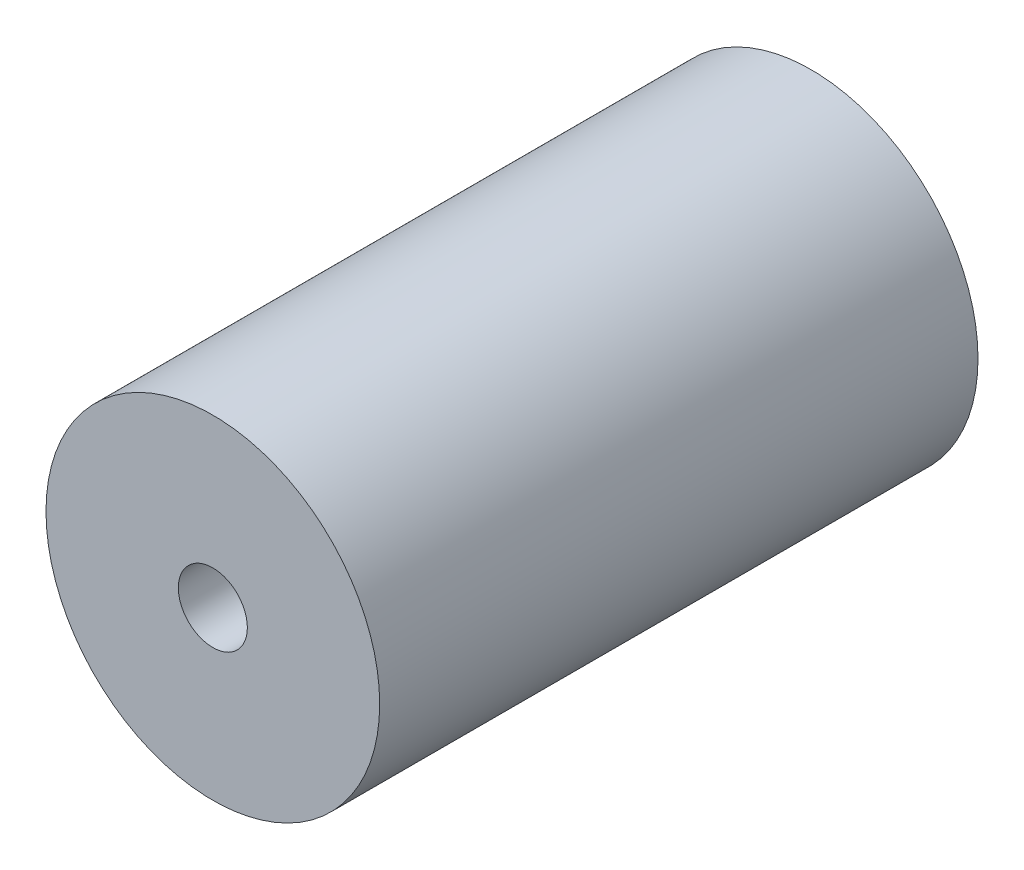
ISO-10303-21;
HEADER;
FILE_DESCRIPTION(('STEP AP214'),'2;1');
FILE_NAME('part.step','',(''),(''),'','','');
FILE_SCHEMA(('AUTOMOTIVE_DESIGN { 1 0 10303 214 1 1 1 1 }'));
ENDSEC;
DATA;
#1=APPLICATION_CONTEXT('core data for automotive mechanical design processes');
#2=APPLICATION_PROTOCOL_DEFINITION('international standard','automotive_design',2000,#1);
#3=PRODUCT_CONTEXT('',#1,'mechanical');
#4=PRODUCT('Part','Part','',(#3));
#5=PRODUCT_RELATED_PRODUCT_CATEGORY('part','',(#4));
#6=PRODUCT_DEFINITION_FORMATION('','',#4);
#7=PRODUCT_DEFINITION_CONTEXT('part definition',#1,'design');
#8=PRODUCT_DEFINITION('design','',#6,#7);
#9=PRODUCT_DEFINITION_SHAPE('','',#8);
#10=(LENGTH_UNIT() NAMED_UNIT(*) SI_UNIT(.MILLI.,.METRE.));
#11=(NAMED_UNIT(*) PLANE_ANGLE_UNIT() SI_UNIT($,.RADIAN.));
#12=(NAMED_UNIT(*) SI_UNIT($,.STERADIAN.) SOLID_ANGLE_UNIT());
#13=UNCERTAINTY_MEASURE_WITH_UNIT(LENGTH_MEASURE(1.E-05),#10,'distance_accuracy_value','');
#14=(GEOMETRIC_REPRESENTATION_CONTEXT(3) GLOBAL_UNCERTAINTY_ASSIGNED_CONTEXT((#13)) GLOBAL_UNIT_ASSIGNED_CONTEXT((#10,
#11,#12)) REPRESENTATION_CONTEXT('',''));
#15=CARTESIAN_POINT('',(0.,0.,0.));
#16=DIRECTION('',(0.,0.,1.));
#17=DIRECTION('',(1.,0.,0.));
#18=AXIS2_PLACEMENT_3D('',#15,#16,#17);
#19=CARTESIAN_POINT('',(0.,0.,0.));
#20=DIRECTION('',(0.,0.,1.));
#21=DIRECTION('',(1.,0.,0.));
#22=AXIS2_PLACEMENT_3D('',#19,#20,#21);
#23=PLANE('',#22);
#24=CARTESIAN_POINT('',(0.,0.,0.));
#25=DIRECTION('',(0.,0.,-1.));
#26=DIRECTION('',(-1.,0.,0.));
#27=AXIS2_PLACEMENT_3D('',#24,#25,#26);
#28=CIRCLE('',#27,1.5);
#29=CARTESIAN_POINT('',(1.5,0.,0.));
#30=VERTEX_POINT('',#29);
#31=EDGE_CURVE('E67',#30,#30,#28,.T.);
#32=ORIENTED_EDGE('',*,*,#31,.F.);
#33=EDGE_LOOP('',(#32));
#34=FACE_BOUND('',#33,.T.);
#35=CARTESIAN_POINT('',(0.,0.,0.));
#36=DIRECTION('',(0.,0.,1.));
#37=DIRECTION('',(1.,0.,0.));
#38=AXIS2_PLACEMENT_3D('',#35,#36,#37);
#39=CIRCLE('',#38,7.25);
#40=CARTESIAN_POINT('',(7.25,0.,0.));
#41=VERTEX_POINT('',#40);
#42=CARTESIAN_POINT('',(-7.25,0.,0.));
#43=VERTEX_POINT('',#42);
#44=EDGE_CURVE('E11',#41,#43,#39,.T.);
#45=ORIENTED_EDGE('',*,*,#44,.F.);
#46=CARTESIAN_POINT('',(0.,0.,0.));
#47=DIRECTION('',(0.,0.,1.));
#48=DIRECTION('',(1.,0.,0.));
#49=AXIS2_PLACEMENT_3D('',#46,#47,#48);
#50=CIRCLE('',#49,7.25);
#51=EDGE_CURVE('E26',#43,#41,#50,.T.);
#52=ORIENTED_EDGE('',*,*,#51,.F.);
#53=EDGE_LOOP('',(#45,#52));
#54=FACE_BOUND('',#53,.T.);
#55=ADVANCED_FACE('F16',(#34,#54),#23,.F.);
#56=CARTESIAN_POINT('',(0.,0.,26.));
#57=DIRECTION('',(0.,0.,1.));
#58=DIRECTION('',(1.,0.,0.));
#59=AXIS2_PLACEMENT_3D('',#56,#57,#58);
#60=PLANE('',#59);
#61=CARTESIAN_POINT('',(0.,0.,26.));
#62=DIRECTION('',(0.,0.,-1.));
#63=DIRECTION('',(-1.,0.,0.));
#64=AXIS2_PLACEMENT_3D('',#61,#62,#63);
#65=CIRCLE('',#64,1.5);
#66=CARTESIAN_POINT('',(1.5,0.,26.));
#67=VERTEX_POINT('',#66);
#68=EDGE_CURVE('E78',#67,#67,#65,.T.);
#69=ORIENTED_EDGE('',*,*,#68,.T.);
#70=EDGE_LOOP('',(#69));
#71=FACE_BOUND('',#70,.T.);
#72=CARTESIAN_POINT('',(0.,0.,26.));
#73=DIRECTION('',(0.,0.,1.));
#74=DIRECTION('',(1.,0.,0.));
#75=AXIS2_PLACEMENT_3D('',#72,#73,#74);
#76=CIRCLE('',#75,7.25);
#77=CARTESIAN_POINT('',(7.25,0.,26.));
#78=VERTEX_POINT('',#77);
#79=CARTESIAN_POINT('',(-7.25,0.,26.));
#80=VERTEX_POINT('',#79);
#81=EDGE_CURVE('E62',#78,#80,#76,.T.);
#82=ORIENTED_EDGE('',*,*,#81,.T.);
#83=CARTESIAN_POINT('',(0.,0.,26.));
#84=DIRECTION('',(0.,0.,1.));
#85=DIRECTION('',(1.,0.,0.));
#86=AXIS2_PLACEMENT_3D('',#83,#84,#85);
#87=CIRCLE('',#86,7.25);
#88=EDGE_CURVE('E61',#80,#78,#87,.T.);
#89=ORIENTED_EDGE('',*,*,#88,.T.);
#90=EDGE_LOOP('',(#82,#89));
#91=FACE_BOUND('',#90,.T.);
#92=ADVANCED_FACE('F18',(#71,#91),#60,.T.);
#93=CARTESIAN_POINT('',(0.,0.,0.));
#94=DIRECTION('',(0.,0.,1.));
#95=DIRECTION('',(1.,0.,0.));
#96=AXIS2_PLACEMENT_3D('',#93,#94,#95);
#97=CYLINDRICAL_SURFACE('',#96,7.25);
#98=ORIENTED_EDGE('',*,*,#81,.F.);
#99=ORIENTED_EDGE('',*,*,#88,.F.);
#100=DIRECTION('',(0.,0.,-1.));
#101=VECTOR('',#100,1.);
#102=CARTESIAN_POINT('',(-7.25,0.,0.));
#103=LINE('',#102,#101);
#104=EDGE_CURVE('E54',#80,#43,#103,.T.);
#105=ORIENTED_EDGE('',*,*,#104,.T.);
#106=ORIENTED_EDGE('',*,*,#51,.T.);
#107=ORIENTED_EDGE('',*,*,#44,.T.);
#108=ORIENTED_EDGE('',*,*,#104,.F.);
#109=EDGE_LOOP('',(#98,#99,#105,#106,#107,#108));
#110=FACE_BOUND('',#109,.T.);
#111=ADVANCED_FACE('F65',(#110),#97,.T.);
#112=CARTESIAN_POINT('',(0.,0.,0.));
#113=DIRECTION('',(0.,0.,1.));
#114=DIRECTION('',(-1.,0.,0.));
#115=AXIS2_PLACEMENT_3D('',#112,#113,#114);
#116=CYLINDRICAL_SURFACE('',#115,1.5);
#117=ORIENTED_EDGE('',*,*,#68,.F.);
#118=DIRECTION('',(0.,0.,-1.));
#119=VECTOR('',#118,1.);
#120=CARTESIAN_POINT('',(1.5,0.,0.));
#121=LINE('',#120,#119);
#122=EDGE_CURVE('E73',#67,#30,#121,.T.);
#123=ORIENTED_EDGE('',*,*,#122,.T.);
#124=ORIENTED_EDGE('',*,*,#31,.T.);
#125=ORIENTED_EDGE('',*,*,#122,.F.);
#126=EDGE_LOOP('',(#117,#123,#124,#125));
#127=FACE_BOUND('',#126,.T.);
#128=ADVANCED_FACE('F95',(#127),#116,.F.);
#129=CLOSED_SHELL('',(#55,#92,#111,#128));
#130=MANIFOLD_SOLID_BREP('B1',#129);
#131=ADVANCED_BREP_SHAPE_REPRESENTATION('',(#18,#130),#14);
#132=SHAPE_DEFINITION_REPRESENTATION(#9,#131);
ENDSEC;
END-ISO-10303-21;
